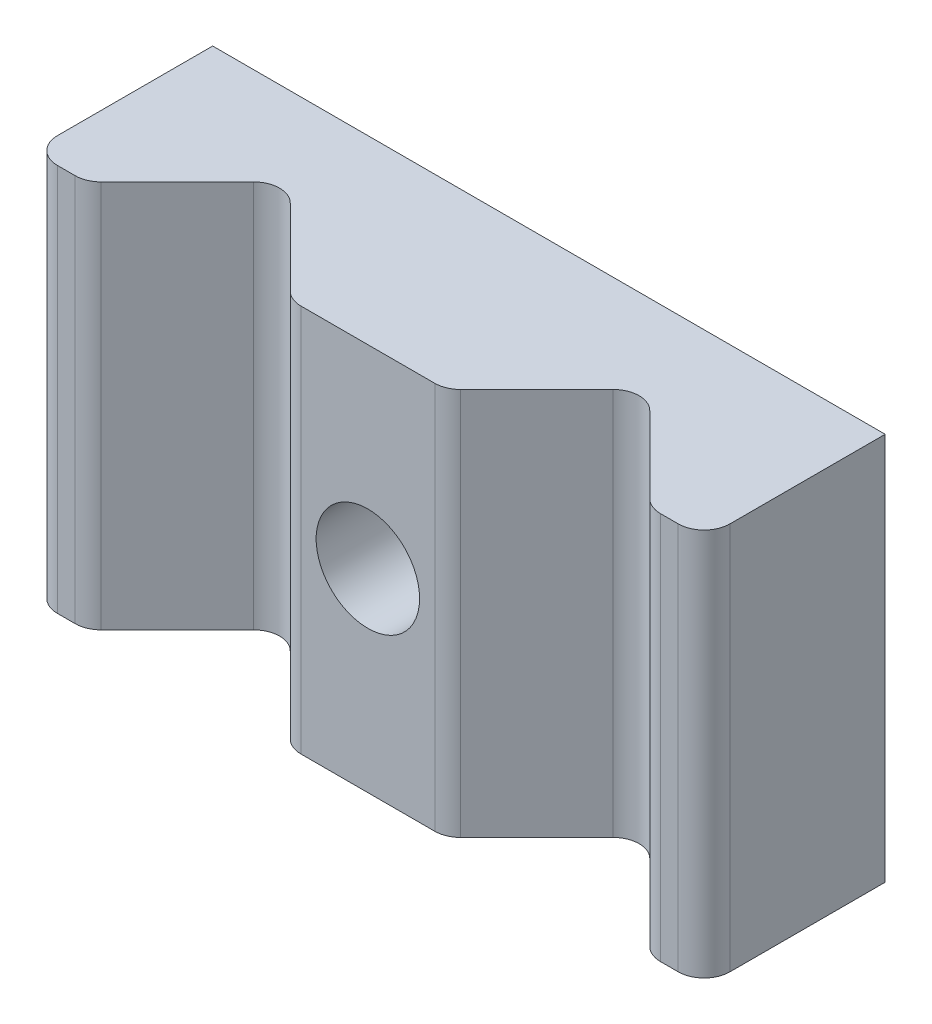
ISO-10303-21;
HEADER;
FILE_DESCRIPTION(('STEP AP214'),'2;1');
FILE_NAME('part.step','',(''),(''),'','','');
FILE_SCHEMA(('AUTOMOTIVE_DESIGN { 1 0 10303 214 1 1 1 1 }'));
ENDSEC;
DATA;
#1=APPLICATION_CONTEXT('core data for automotive mechanical design processes');
#2=APPLICATION_PROTOCOL_DEFINITION('international standard','automotive_design',2000,#1);
#3=PRODUCT_CONTEXT('',#1,'mechanical');
#4=PRODUCT('Part','Part','',(#3));
#5=PRODUCT_RELATED_PRODUCT_CATEGORY('part','',(#4));
#6=PRODUCT_DEFINITION_FORMATION('','',#4);
#7=PRODUCT_DEFINITION_CONTEXT('part definition',#1,'design');
#8=PRODUCT_DEFINITION('design','',#6,#7);
#9=PRODUCT_DEFINITION_SHAPE('','',#8);
#10=(LENGTH_UNIT() NAMED_UNIT(*) SI_UNIT(.MILLI.,.METRE.));
#11=(NAMED_UNIT(*) PLANE_ANGLE_UNIT() SI_UNIT($,.RADIAN.));
#12=(NAMED_UNIT(*) SI_UNIT($,.STERADIAN.) SOLID_ANGLE_UNIT());
#13=UNCERTAINTY_MEASURE_WITH_UNIT(LENGTH_MEASURE(1.E-05),#10,'distance_accuracy_value','');
#14=(GEOMETRIC_REPRESENTATION_CONTEXT(3) GLOBAL_UNCERTAINTY_ASSIGNED_CONTEXT((#13)) GLOBAL_UNIT_ASSIGNED_CONTEXT((#10,
#11,#12)) REPRESENTATION_CONTEXT('',''));
#15=CARTESIAN_POINT('',(0.,0.,0.));
#16=DIRECTION('',(0.,0.,1.));
#17=DIRECTION('',(1.,0.,0.));
#18=AXIS2_PLACEMENT_3D('',#15,#16,#17);
#19=CARTESIAN_POINT('',(0.,15.,7.));
#20=DIRECTION('',(0.,0.,-1.));
#21=DIRECTION('',(-1.,0.,0.));
#22=AXIS2_PLACEMENT_3D('',#19,#20,#21);
#23=PLANE('',#22);
#24=CARTESIAN_POINT('',(13.,7.5,7.));
#25=DIRECTION('',(0.,0.,1.));
#26=DIRECTION('',(1.,0.,0.));
#27=AXIS2_PLACEMENT_3D('',#24,#25,#26);
#28=CIRCLE('',#27,2.);
#29=CARTESIAN_POINT('',(15.,7.5,7.));
#30=VERTEX_POINT('',#29);
#31=EDGE_CURVE('E217',#30,#30,#28,.T.);
#32=ORIENTED_EDGE('',*,*,#31,.F.);
#33=EDGE_LOOP('',(#32));
#34=FACE_BOUND('',#33,.T.);
#35=DIRECTION('',(-1.,0.,0.));
#36=VECTOR('',#35,1.);
#37=CARTESIAN_POINT('',(0.,15.,7.));
#38=LINE('',#37,#36);
#39=CARTESIAN_POINT('',(15.5860389693211,15.,7.));
#40=VERTEX_POINT('',#39);
#41=CARTESIAN_POINT('',(10.4139610306789,15.,7.));
#42=VERTEX_POINT('',#41);
#43=EDGE_CURVE('E233',#40,#42,#38,.T.);
#44=ORIENTED_EDGE('',*,*,#43,.T.);
#45=DIRECTION('',(0.,1.,0.));
#46=VECTOR('',#45,1.);
#47=CARTESIAN_POINT('',(10.4139610306789,15.,7.));
#48=LINE('',#47,#46);
#49=CARTESIAN_POINT('',(10.4139610306789,0.,7.));
#50=VERTEX_POINT('',#49);
#51=EDGE_CURVE('E288',#42,#50,#48,.F.);
#52=ORIENTED_EDGE('',*,*,#51,.T.);
#53=DIRECTION('',(1.,0.,0.));
#54=VECTOR('',#53,1.);
#55=CARTESIAN_POINT('',(0.,0.,7.));
#56=LINE('',#55,#54);
#57=CARTESIAN_POINT('',(15.5860389693211,0.,7.));
#58=VERTEX_POINT('',#57);
#59=EDGE_CURVE('E226',#50,#58,#56,.T.);
#60=ORIENTED_EDGE('',*,*,#59,.T.);
#61=DIRECTION('',(0.,1.,0.));
#62=VECTOR('',#61,1.);
#63=CARTESIAN_POINT('',(15.5860389693211,15.,7.));
#64=LINE('',#63,#62);
#65=EDGE_CURVE('E285',#58,#40,#64,.T.);
#66=ORIENTED_EDGE('',*,*,#65,.T.);
#67=EDGE_LOOP('',(#44,#52,#60,#66));
#68=FACE_BOUND('',#67,.T.);
#69=ADVANCED_FACE('F33',(#34,#68),#23,.F.);
#70=CARTESIAN_POINT('',(1.68603896932107,15.,7.));
#71=VERTEX_POINT('',#70);
#72=CARTESIAN_POINT('',(1.,15.,7.));
#73=VERTEX_POINT('',#72);
#74=EDGE_CURVE('E234',#71,#73,#38,.T.);
#75=ORIENTED_EDGE('',*,*,#74,.T.);
#76=DIRECTION('',(0.,-1.,0.));
#77=VECTOR('',#76,1.);
#78=CARTESIAN_POINT('',(1.,15.,7.));
#79=LINE('',#78,#77);
#80=CARTESIAN_POINT('',(1.,0.,7.));
#81=VERTEX_POINT('',#80);
#82=EDGE_CURVE('E255',#73,#81,#79,.T.);
#83=ORIENTED_EDGE('',*,*,#82,.T.);
#84=CARTESIAN_POINT('',(1.68603896932108,0.,7.));
#85=VERTEX_POINT('',#84);
#86=EDGE_CURVE('E228',#81,#85,#56,.T.);
#87=ORIENTED_EDGE('',*,*,#86,.T.);
#88=DIRECTION('',(0.,1.,0.));
#89=VECTOR('',#88,1.);
#90=CARTESIAN_POINT('',(1.68603896932107,15.,7.));
#91=LINE('',#90,#89);
#92=EDGE_CURVE('E252',#85,#71,#91,.T.);
#93=ORIENTED_EDGE('',*,*,#92,.T.);
#94=EDGE_LOOP('',(#75,#83,#87,#93));
#95=FACE_BOUND('',#94,.T.);
#96=ADVANCED_FACE('F342',(#95),#23,.F.);
#97=CARTESIAN_POINT('',(25.,15.,7.));
#98=VERTEX_POINT('',#97);
#99=CARTESIAN_POINT('',(24.3139610306789,15.,7.));
#100=VERTEX_POINT('',#99);
#101=EDGE_CURVE('E229',#98,#100,#38,.T.);
#102=ORIENTED_EDGE('',*,*,#101,.T.);
#103=DIRECTION('',(0.,1.,0.));
#104=VECTOR('',#103,1.);
#105=CARTESIAN_POINT('',(24.3139610306789,15.,7.));
#106=LINE('',#105,#104);
#107=CARTESIAN_POINT('',(24.3139610306789,0.,7.));
#108=VERTEX_POINT('',#107);
#109=EDGE_CURVE('E41',#100,#108,#106,.F.);
#110=ORIENTED_EDGE('',*,*,#109,.T.);
#111=CARTESIAN_POINT('',(25.,0.,7.));
#112=VERTEX_POINT('',#111);
#113=EDGE_CURVE('E223',#108,#112,#56,.T.);
#114=ORIENTED_EDGE('',*,*,#113,.T.);
#115=DIRECTION('',(0.,1.,0.));
#116=VECTOR('',#115,1.);
#117=CARTESIAN_POINT('',(25.,15.,7.));
#118=LINE('',#117,#116);
#119=EDGE_CURVE('E294',#112,#98,#118,.T.);
#120=ORIENTED_EDGE('',*,*,#119,.T.);
#121=EDGE_LOOP('',(#102,#110,#114,#120));
#122=FACE_BOUND('',#121,.T.);
#123=ADVANCED_FACE('F298',(#122),#23,.F.);
#124=CARTESIAN_POINT('',(0.,15.,0.));
#125=DIRECTION('',(0.,0.,-1.));
#126=DIRECTION('',(-1.,0.,0.));
#127=AXIS2_PLACEMENT_3D('',#124,#125,#126);
#128=PLANE('',#127);
#129=DIRECTION('',(0.,-1.,0.));
#130=VECTOR('',#129,1.);
#131=CARTESIAN_POINT('',(0.,0.,0.));
#132=LINE('',#131,#130);
#133=CARTESIAN_POINT('',(0.,15.,0.));
#134=VERTEX_POINT('',#133);
#135=CARTESIAN_POINT('',(0.,0.,0.));
#136=VERTEX_POINT('',#135);
#137=EDGE_CURVE('E220',#134,#136,#132,.T.);
#138=ORIENTED_EDGE('',*,*,#137,.F.);
#139=DIRECTION('',(-1.,0.,0.));
#140=VECTOR('',#139,1.);
#141=CARTESIAN_POINT('',(0.,15.,0.));
#142=LINE('',#141,#140);
#143=CARTESIAN_POINT('',(26.,15.,0.));
#144=VERTEX_POINT('',#143);
#145=EDGE_CURVE('E227',#144,#134,#142,.T.);
#146=ORIENTED_EDGE('',*,*,#145,.F.);
#147=DIRECTION('',(0.,1.,0.));
#148=VECTOR('',#147,1.);
#149=CARTESIAN_POINT('',(26.,0.,0.));
#150=LINE('',#149,#148);
#151=CARTESIAN_POINT('',(26.,0.,0.));
#152=VERTEX_POINT('',#151);
#153=EDGE_CURVE('E240',#152,#144,#150,.T.);
#154=ORIENTED_EDGE('',*,*,#153,.F.);
#155=DIRECTION('',(1.,0.,0.));
#156=VECTOR('',#155,1.);
#157=CARTESIAN_POINT('',(0.,0.,0.));
#158=LINE('',#157,#156);
#159=EDGE_CURVE('E237',#136,#152,#158,.T.);
#160=ORIENTED_EDGE('',*,*,#159,.F.);
#161=EDGE_LOOP('',(#138,#146,#154,#160));
#162=FACE_BOUND('',#161,.T.);
#163=CARTESIAN_POINT('',(13.,7.5,0.));
#164=DIRECTION('',(0.,0.,1.));
#165=DIRECTION('',(1.,0.,0.));
#166=AXIS2_PLACEMENT_3D('',#163,#164,#165);
#167=CIRCLE('',#166,2.);
#168=CARTESIAN_POINT('',(15.,7.5,0.));
#169=VERTEX_POINT('',#168);
#170=EDGE_CURVE('E214',#169,#169,#167,.T.);
#171=ORIENTED_EDGE('',*,*,#170,.T.);
#172=EDGE_LOOP('',(#171));
#173=FACE_BOUND('',#172,.T.);
#174=ADVANCED_FACE('F354',(#162,#173),#128,.T.);
#175=CARTESIAN_POINT('',(0.,0.,7.));
#176=DIRECTION('',(1.,0.,0.));
#177=DIRECTION('',(0.,0.,-1.));
#178=AXIS2_PLACEMENT_3D('',#175,#176,#177);
#179=PLANE('',#178);
#180=DIRECTION('',(0.,0.,-1.));
#181=VECTOR('',#180,1.);
#182=CARTESIAN_POINT('',(0.,0.,7.));
#183=LINE('',#182,#181);
#184=CARTESIAN_POINT('',(0.,0.,6.));
#185=VERTEX_POINT('',#184);
#186=EDGE_CURVE('E250',#185,#136,#183,.T.);
#187=ORIENTED_EDGE('',*,*,#186,.F.);
#188=DIRECTION('',(0.,-1.,0.));
#189=VECTOR('',#188,1.);
#190=CARTESIAN_POINT('',(0.,0.,6.));
#191=LINE('',#190,#189);
#192=CARTESIAN_POINT('',(0.,15.,6.));
#193=VERTEX_POINT('',#192);
#194=EDGE_CURVE('E269',#185,#193,#191,.F.);
#195=ORIENTED_EDGE('',*,*,#194,.T.);
#196=DIRECTION('',(0.,0.,-1.));
#197=VECTOR('',#196,1.);
#198=CARTESIAN_POINT('',(0.,15.,7.));
#199=LINE('',#198,#197);
#200=EDGE_CURVE('E232',#193,#134,#199,.T.);
#201=ORIENTED_EDGE('',*,*,#200,.T.);
#202=ORIENTED_EDGE('',*,*,#137,.T.);
#203=EDGE_LOOP('',(#187,#195,#201,#202));
#204=FACE_BOUND('',#203,.T.);
#205=ADVANCED_FACE('F350',(#204),#179,.F.);
#206=CARTESIAN_POINT('',(0.,0.,7.));
#207=DIRECTION('',(0.,1.,0.));
#208=DIRECTION('',(-1.,0.,0.));
#209=AXIS2_PLACEMENT_3D('',#206,#207,#208);
#210=PLANE('',#209);
#211=ORIENTED_EDGE('',*,*,#86,.F.);
#212=CARTESIAN_POINT('',(1.,0.,6.));
#213=DIRECTION('',(0.,1.,0.));
#214=DIRECTION('',(-1.,0.,0.));
#215=AXIS2_PLACEMENT_3D('',#212,#213,#214);
#216=CIRCLE('',#215,1.);
#217=EDGE_CURVE('E267',#81,#185,#216,.F.);
#218=ORIENTED_EDGE('',*,*,#217,.T.);
#219=ORIENTED_EDGE('',*,*,#186,.T.);
#220=ORIENTED_EDGE('',*,*,#159,.T.);
#221=DIRECTION('',(0.,0.,-1.));
#222=VECTOR('',#221,1.);
#223=CARTESIAN_POINT('',(26.,0.,7.));
#224=LINE('',#223,#222);
#225=CARTESIAN_POINT('',(26.,0.,6.));
#226=VERTEX_POINT('',#225);
#227=EDGE_CURVE('E248',#226,#152,#224,.T.);
#228=ORIENTED_EDGE('',*,*,#227,.F.);
#229=CARTESIAN_POINT('',(25.,0.,6.));
#230=DIRECTION('',(0.,1.,0.));
#231=DIRECTION('',(-1.,0.,0.));
#232=AXIS2_PLACEMENT_3D('',#229,#230,#231);
#233=CIRCLE('',#232,1.);
#234=EDGE_CURVE('E258',#226,#112,#233,.F.);
#235=ORIENTED_EDGE('',*,*,#234,.T.);
#236=ORIENTED_EDGE('',*,*,#113,.F.);
#237=CARTESIAN_POINT('',(24.3139610306789,0.,6.));
#238=DIRECTION('',(0.,1.,0.));
#239=DIRECTION('',(-1.,0.,0.));
#240=AXIS2_PLACEMENT_3D('',#237,#238,#239);
#241=CIRCLE('',#240,1.);
#242=CARTESIAN_POINT('',(23.6068542494924,0.,6.70710678118655));
#243=VERTEX_POINT('',#242);
#244=EDGE_CURVE('E168',#108,#243,#241,.F.);
#245=ORIENTED_EDGE('',*,*,#244,.T.);
#246=DIRECTION('',(-0.707106781186548,0.,-0.707106781186547));
#247=VECTOR('',#246,1.);
#248=CARTESIAN_POINT('',(20.6571067811866,0.,3.75735931288072));
#249=LINE('',#248,#247);
#250=CARTESIAN_POINT('',(20.6571067811866,0.,3.75735931288071));
#251=VERTEX_POINT('',#250);
#252=EDGE_CURVE('E159',#243,#251,#249,.T.);
#253=ORIENTED_EDGE('',*,*,#252,.T.);
#254=CARTESIAN_POINT('',(19.95,0.,4.46446609406726));
#255=DIRECTION('',(0.,1.,0.));
#256=DIRECTION('',(1.,0.,0.));
#257=AXIS2_PLACEMENT_3D('',#254,#255,#256);
#258=CIRCLE('',#257,0.999999999999999);
#259=CARTESIAN_POINT('',(19.2428932188135,0.,3.75735931288072));
#260=VERTEX_POINT('',#259);
#261=EDGE_CURVE('E165',#251,#260,#258,.T.);
#262=ORIENTED_EDGE('',*,*,#261,.T.);
#263=DIRECTION('',(-0.707106781186548,0.,0.707106781186547));
#264=VECTOR('',#263,1.);
#265=CARTESIAN_POINT('',(16.0002525316942,0.,7.));
#266=LINE('',#265,#264);
#267=CARTESIAN_POINT('',(16.2931457505076,0.,6.70710678118655));
#268=VERTEX_POINT('',#267);
#269=EDGE_CURVE('E183',#260,#268,#266,.T.);
#270=ORIENTED_EDGE('',*,*,#269,.T.);
#271=CARTESIAN_POINT('',(15.5860389693211,0.,6.));
#272=DIRECTION('',(0.,1.,0.));
#273=DIRECTION('',(-1.,0.,0.));
#274=AXIS2_PLACEMENT_3D('',#271,#272,#273);
#275=CIRCLE('',#274,1.);
#276=EDGE_CURVE('E261',#268,#58,#275,.F.);
#277=ORIENTED_EDGE('',*,*,#276,.T.);
#278=ORIENTED_EDGE('',*,*,#59,.F.);
#279=CARTESIAN_POINT('',(10.4139610306789,0.,6.));
#280=DIRECTION('',(0.,1.,0.));
#281=DIRECTION('',(-1.,0.,0.));
#282=AXIS2_PLACEMENT_3D('',#279,#280,#281);
#283=CIRCLE('',#282,1.);
#284=CARTESIAN_POINT('',(9.70685424949238,0.,6.70710678118655));
#285=VERTEX_POINT('',#284);
#286=EDGE_CURVE('E263',#50,#285,#283,.F.);
#287=ORIENTED_EDGE('',*,*,#286,.T.);
#288=DIRECTION('',(-0.707106781186547,0.,-0.707106781186548));
#289=VECTOR('',#288,1.);
#290=CARTESIAN_POINT('',(6.75710678118655,0.,3.75735931288072));
#291=LINE('',#290,#289);
#292=CARTESIAN_POINT('',(6.75710678118655,0.,3.75735931288072));
#293=VERTEX_POINT('',#292);
#294=EDGE_CURVE('E197',#285,#293,#291,.T.);
#295=ORIENTED_EDGE('',*,*,#294,.T.);
#296=CARTESIAN_POINT('',(6.05,0.,4.46446609406726));
#297=DIRECTION('',(0.,1.,0.));
#298=DIRECTION('',(1.,0.,0.));
#299=AXIS2_PLACEMENT_3D('',#296,#297,#298);
#300=CIRCLE('',#299,0.999999999999999);
#301=CARTESIAN_POINT('',(5.34289321881346,0.,3.75735931288072));
#302=VERTEX_POINT('',#301);
#303=EDGE_CURVE('E199',#293,#302,#300,.T.);
#304=ORIENTED_EDGE('',*,*,#303,.T.);
#305=DIRECTION('',(-0.707106781186548,0.,0.707106781186547));
#306=VECTOR('',#305,1.);
#307=CARTESIAN_POINT('',(2.10025253169417,0.,7.));
#308=LINE('',#307,#306);
#309=CARTESIAN_POINT('',(2.39314575050763,0.,6.70710678118655));
#310=VERTEX_POINT('',#309);
#311=EDGE_CURVE('E203',#302,#310,#308,.T.);
#312=ORIENTED_EDGE('',*,*,#311,.T.);
#313=CARTESIAN_POINT('',(1.68603896932108,0.,6.));
#314=DIRECTION('',(0.,1.,0.));
#315=DIRECTION('',(-1.,0.,0.));
#316=AXIS2_PLACEMENT_3D('',#313,#314,#315);
#317=CIRCLE('',#316,1.);
#318=EDGE_CURVE('E265',#310,#85,#317,.F.);
#319=ORIENTED_EDGE('',*,*,#318,.T.);
#320=EDGE_LOOP('',(#211,#218,#219,#220,#228,#235,#236,#245,#253,#262,#270,#277,#278,#287,#295,
#304,#312,#319));
#321=FACE_BOUND('',#320,.T.);
#322=ADVANCED_FACE('F162',(#321),#210,.F.);
#323=CARTESIAN_POINT('',(26.,0.,7.));
#324=DIRECTION('',(-1.,0.,0.));
#325=DIRECTION('',(0.,-1.,0.));
#326=AXIS2_PLACEMENT_3D('',#323,#324,#325);
#327=PLANE('',#326);
#328=DIRECTION('',(0.,0.,-1.));
#329=VECTOR('',#328,1.);
#330=CARTESIAN_POINT('',(26.,15.,7.));
#331=LINE('',#330,#329);
#332=CARTESIAN_POINT('',(26.,15.,6.));
#333=VERTEX_POINT('',#332);
#334=EDGE_CURVE('E246',#333,#144,#331,.T.);
#335=ORIENTED_EDGE('',*,*,#334,.F.);
#336=DIRECTION('',(0.,1.,0.));
#337=VECTOR('',#336,1.);
#338=CARTESIAN_POINT('',(26.,0.,6.));
#339=LINE('',#338,#337);
#340=EDGE_CURVE('E11',#333,#226,#339,.F.);
#341=ORIENTED_EDGE('',*,*,#340,.T.);
#342=ORIENTED_EDGE('',*,*,#227,.T.);
#343=ORIENTED_EDGE('',*,*,#153,.T.);
#344=EDGE_LOOP('',(#335,#341,#342,#343));
#345=FACE_BOUND('',#344,.T.);
#346=ADVANCED_FACE('F361',(#345),#327,.F.);
#347=CARTESIAN_POINT('',(0.,15.,7.));
#348=DIRECTION('',(0.,-1.,0.));
#349=DIRECTION('',(1.,0.,0.));
#350=AXIS2_PLACEMENT_3D('',#347,#348,#349);
#351=PLANE('',#350);
#352=ORIENTED_EDGE('',*,*,#200,.F.);
#353=CARTESIAN_POINT('',(1.,15.,6.));
#354=DIRECTION('',(0.,-1.,0.));
#355=DIRECTION('',(1.,0.,0.));
#356=AXIS2_PLACEMENT_3D('',#353,#354,#355);
#357=CIRCLE('',#356,1.);
#358=EDGE_CURVE('E279',#193,#73,#357,.F.);
#359=ORIENTED_EDGE('',*,*,#358,.T.);
#360=ORIENTED_EDGE('',*,*,#74,.F.);
#361=CARTESIAN_POINT('',(1.68603896932107,15.,6.));
#362=DIRECTION('',(0.,-1.,0.));
#363=DIRECTION('',(1.,0.,0.));
#364=AXIS2_PLACEMENT_3D('',#361,#362,#363);
#365=CIRCLE('',#364,1.);
#366=CARTESIAN_POINT('',(2.39314575050762,15.,6.70710678118655));
#367=VERTEX_POINT('',#366);
#368=EDGE_CURVE('E56',#71,#367,#365,.F.);
#369=ORIENTED_EDGE('',*,*,#368,.T.);
#370=DIRECTION('',(-0.707106781186548,0.,0.707106781186547));
#371=VECTOR('',#370,1.);
#372=CARTESIAN_POINT('',(2.10025253169417,15.,7.));
#373=LINE('',#372,#371);
#374=CARTESIAN_POINT('',(5.34289321881345,15.,3.75735931288072));
#375=VERTEX_POINT('',#374);
#376=EDGE_CURVE('E200',#375,#367,#373,.T.);
#377=ORIENTED_EDGE('',*,*,#376,.F.);
#378=CARTESIAN_POINT('',(6.05,15.,4.46446609406726));
#379=DIRECTION('',(0.,1.,0.));
#380=DIRECTION('',(1.,0.,0.));
#381=AXIS2_PLACEMENT_3D('',#378,#379,#380);
#382=CIRCLE('',#381,0.999999999999999);
#383=CARTESIAN_POINT('',(6.75710678118655,15.,3.75735931288072));
#384=VERTEX_POINT('',#383);
#385=EDGE_CURVE('E208',#384,#375,#382,.T.);
#386=ORIENTED_EDGE('',*,*,#385,.F.);
#387=DIRECTION('',(-0.707106781186547,0.,-0.707106781186548));
#388=VECTOR('',#387,1.);
#389=CARTESIAN_POINT('',(6.75710678118655,15.,3.75735931288072));
#390=LINE('',#389,#388);
#391=CARTESIAN_POINT('',(9.70685424949238,15.,6.70710678118655));
#392=VERTEX_POINT('',#391);
#393=EDGE_CURVE('E195',#392,#384,#390,.T.);
#394=ORIENTED_EDGE('',*,*,#393,.F.);
#395=CARTESIAN_POINT('',(10.4139610306789,15.,6.));
#396=DIRECTION('',(0.,-1.,0.));
#397=DIRECTION('',(1.,0.,0.));
#398=AXIS2_PLACEMENT_3D('',#395,#396,#397);
#399=CIRCLE('',#398,1.);
#400=EDGE_CURVE('E48',#392,#42,#399,.F.);
#401=ORIENTED_EDGE('',*,*,#400,.T.);
#402=ORIENTED_EDGE('',*,*,#43,.F.);
#403=CARTESIAN_POINT('',(15.5860389693211,15.,6.));
#404=DIRECTION('',(0.,-1.,0.));
#405=DIRECTION('',(1.,0.,0.));
#406=AXIS2_PLACEMENT_3D('',#403,#404,#405);
#407=CIRCLE('',#406,1.);
#408=CARTESIAN_POINT('',(16.2931457505076,15.,6.70710678118655));
#409=VERTEX_POINT('',#408);
#410=EDGE_CURVE('E275',#40,#409,#407,.F.);
#411=ORIENTED_EDGE('',*,*,#410,.T.);
#412=DIRECTION('',(-0.707106781186548,0.,0.707106781186547));
#413=VECTOR('',#412,1.);
#414=CARTESIAN_POINT('',(16.0002525316942,15.,7.));
#415=LINE('',#414,#413);
#416=CARTESIAN_POINT('',(19.2428932188135,15.,3.75735931288072));
#417=VERTEX_POINT('',#416);
#418=EDGE_CURVE('E172',#417,#409,#415,.T.);
#419=ORIENTED_EDGE('',*,*,#418,.F.);
#420=CARTESIAN_POINT('',(19.95,15.,4.46446609406726));
#421=DIRECTION('',(0.,1.,0.));
#422=DIRECTION('',(1.,0.,0.));
#423=AXIS2_PLACEMENT_3D('',#420,#421,#422);
#424=CIRCLE('',#423,0.999999999999999);
#425=CARTESIAN_POINT('',(20.6571067811865,15.,3.75735931288071));
#426=VERTEX_POINT('',#425);
#427=EDGE_CURVE('E191',#426,#417,#424,.T.);
#428=ORIENTED_EDGE('',*,*,#427,.F.);
#429=DIRECTION('',(-0.707106781186548,0.,-0.707106781186547));
#430=VECTOR('',#429,1.);
#431=CARTESIAN_POINT('',(20.6571067811865,15.,3.75735931288072));
#432=LINE('',#431,#430);
#433=CARTESIAN_POINT('',(23.6068542494924,15.,6.70710678118655));
#434=VERTEX_POINT('',#433);
#435=EDGE_CURVE('E178',#434,#426,#432,.T.);
#436=ORIENTED_EDGE('',*,*,#435,.F.);
#437=CARTESIAN_POINT('',(24.3139610306789,15.,6.));
#438=DIRECTION('',(0.,-1.,0.));
#439=DIRECTION('',(1.,0.,0.));
#440=AXIS2_PLACEMENT_3D('',#437,#438,#439);
#441=CIRCLE('',#440,1.);
#442=EDGE_CURVE('E273',#434,#100,#441,.F.);
#443=ORIENTED_EDGE('',*,*,#442,.T.);
#444=ORIENTED_EDGE('',*,*,#101,.F.);
#445=CARTESIAN_POINT('',(25.,15.,6.));
#446=DIRECTION('',(0.,-1.,0.));
#447=DIRECTION('',(1.,0.,0.));
#448=AXIS2_PLACEMENT_3D('',#445,#446,#447);
#449=CIRCLE('',#448,1.);
#450=EDGE_CURVE('E271',#98,#333,#449,.F.);
#451=ORIENTED_EDGE('',*,*,#450,.T.);
#452=ORIENTED_EDGE('',*,*,#334,.T.);
#453=ORIENTED_EDGE('',*,*,#145,.T.);
#454=EDGE_LOOP('',(#352,#359,#360,#369,#377,#386,#394,#401,#402,#411,#419,#428,#436,#443,#444,
#451,#452,#453));
#455=FACE_BOUND('',#454,.T.);
#456=ADVANCED_FACE('F306',(#455),#351,.F.);
#457=CARTESIAN_POINT('',(13.,7.5,7.));
#458=DIRECTION('',(0.,0.,-1.));
#459=DIRECTION('',(-1.,0.,0.));
#460=AXIS2_PLACEMENT_3D('',#457,#458,#459);
#461=CYLINDRICAL_SURFACE('',#460,2.);
#462=ORIENTED_EDGE('',*,*,#31,.T.);
#463=EDGE_LOOP('',(#462));
#464=FACE_BOUND('',#463,.T.);
#465=ORIENTED_EDGE('',*,*,#170,.F.);
#466=EDGE_LOOP('',(#465));
#467=FACE_BOUND('',#466,.T.);
#468=ADVANCED_FACE('F368',(#464,#467),#461,.F.);
#469=CARTESIAN_POINT('',(2.10025253169417,0.,7.));
#470=DIRECTION('',(-0.707106781186547,0.,-0.707106781186548));
#471=DIRECTION('',(-0.707106781186548,0.,0.707106781186547));
#472=AXIS2_PLACEMENT_3D('',#469,#470,#471);
#473=PLANE('',#472);
#474=ORIENTED_EDGE('',*,*,#376,.T.);
#475=DIRECTION('',(0.,1.,0.));
#476=VECTOR('',#475,1.);
#477=CARTESIAN_POINT('',(2.39314575050763,0.,6.70710678118655));
#478=LINE('',#477,#476);
#479=EDGE_CURVE('E281',#367,#310,#478,.F.);
#480=ORIENTED_EDGE('',*,*,#479,.T.);
#481=ORIENTED_EDGE('',*,*,#311,.F.);
#482=DIRECTION('',(0.,1.,0.));
#483=VECTOR('',#482,1.);
#484=CARTESIAN_POINT('',(5.34289321881346,0.,3.75735931288072));
#485=LINE('',#484,#483);
#486=EDGE_CURVE('E212',#302,#375,#485,.T.);
#487=ORIENTED_EDGE('',*,*,#486,.T.);
#488=EDGE_LOOP('',(#474,#480,#481,#487));
#489=FACE_BOUND('',#488,.T.);
#490=ADVANCED_FACE('F465',(#489),#473,.F.);
#491=CARTESIAN_POINT('',(6.05,0.,4.46446609406726));
#492=DIRECTION('',(0.,1.,0.));
#493=DIRECTION('',(-1.,0.,0.));
#494=AXIS2_PLACEMENT_3D('',#491,#492,#493);
#495=CYLINDRICAL_SURFACE('',#494,0.999999999999999);
#496=ORIENTED_EDGE('',*,*,#385,.T.);
#497=ORIENTED_EDGE('',*,*,#486,.F.);
#498=ORIENTED_EDGE('',*,*,#303,.F.);
#499=DIRECTION('',(0.,1.,0.));
#500=VECTOR('',#499,1.);
#501=CARTESIAN_POINT('',(6.75710678118655,0.,3.75735931288072));
#502=LINE('',#501,#500);
#503=EDGE_CURVE('E206',#293,#384,#502,.T.);
#504=ORIENTED_EDGE('',*,*,#503,.T.);
#505=EDGE_LOOP('',(#496,#497,#498,#504));
#506=FACE_BOUND('',#505,.T.);
#507=ADVANCED_FACE('F335',(#506),#495,.F.);
#508=CARTESIAN_POINT('',(6.75710678118655,0.,3.75735931288072));
#509=DIRECTION('',(0.707106781186548,0.,-0.707106781186547));
#510=DIRECTION('',(-0.707106781186547,0.,-0.707106781186548));
#511=AXIS2_PLACEMENT_3D('',#508,#509,#510);
#512=PLANE('',#511);
#513=ORIENTED_EDGE('',*,*,#294,.F.);
#514=DIRECTION('',(0.,1.,0.));
#515=VECTOR('',#514,1.);
#516=CARTESIAN_POINT('',(9.70685424949238,0.,6.70710678118655));
#517=LINE('',#516,#515);
#518=EDGE_CURVE('E283',#285,#392,#517,.T.);
#519=ORIENTED_EDGE('',*,*,#518,.T.);
#520=ORIENTED_EDGE('',*,*,#393,.T.);
#521=ORIENTED_EDGE('',*,*,#503,.F.);
#522=EDGE_LOOP('',(#513,#519,#520,#521));
#523=FACE_BOUND('',#522,.T.);
#524=ADVANCED_FACE('F330',(#523),#512,.F.);
#525=CARTESIAN_POINT('',(16.0002525316942,0.,7.));
#526=DIRECTION('',(-0.707106781186547,0.,-0.707106781186548));
#527=DIRECTION('',(-0.707106781186548,0.,0.707106781186547));
#528=AXIS2_PLACEMENT_3D('',#525,#526,#527);
#529=PLANE('',#528);
#530=ORIENTED_EDGE('',*,*,#418,.T.);
#531=DIRECTION('',(0.,1.,0.));
#532=VECTOR('',#531,1.);
#533=CARTESIAN_POINT('',(16.2931457505076,0.,6.70710678118655));
#534=LINE('',#533,#532);
#535=EDGE_CURVE('E290',#409,#268,#534,.F.);
#536=ORIENTED_EDGE('',*,*,#535,.T.);
#537=ORIENTED_EDGE('',*,*,#269,.F.);
#538=DIRECTION('',(0.,1.,0.));
#539=VECTOR('',#538,1.);
#540=CARTESIAN_POINT('',(19.2428932188135,0.,3.75735931288072));
#541=LINE('',#540,#539);
#542=EDGE_CURVE('E182',#260,#417,#541,.T.);
#543=ORIENTED_EDGE('',*,*,#542,.T.);
#544=EDGE_LOOP('',(#530,#536,#537,#543));
#545=FACE_BOUND('',#544,.T.);
#546=ADVANCED_FACE('F311',(#545),#529,.F.);
#547=CARTESIAN_POINT('',(19.95,0.,4.46446609406726));
#548=DIRECTION('',(0.,1.,0.));
#549=DIRECTION('',(-1.,0.,0.));
#550=AXIS2_PLACEMENT_3D('',#547,#548,#549);
#551=CYLINDRICAL_SURFACE('',#550,0.999999999999999);
#552=ORIENTED_EDGE('',*,*,#427,.T.);
#553=ORIENTED_EDGE('',*,*,#542,.F.);
#554=ORIENTED_EDGE('',*,*,#261,.F.);
#555=DIRECTION('',(0.,1.,0.));
#556=VECTOR('',#555,1.);
#557=CARTESIAN_POINT('',(20.6571067811866,0.,3.75735931288071));
#558=LINE('',#557,#556);
#559=EDGE_CURVE('E175',#251,#426,#558,.T.);
#560=ORIENTED_EDGE('',*,*,#559,.T.);
#561=EDGE_LOOP('',(#552,#553,#554,#560));
#562=FACE_BOUND('',#561,.T.);
#563=ADVANCED_FACE('F185',(#562),#551,.F.);
#564=CARTESIAN_POINT('',(20.6571067811866,0.,3.75735931288072));
#565=DIRECTION('',(0.707106781186547,0.,-0.707106781186548));
#566=DIRECTION('',(-0.707106781186548,0.,-0.707106781186547));
#567=AXIS2_PLACEMENT_3D('',#564,#565,#566);
#568=PLANE('',#567);
#569=ORIENTED_EDGE('',*,*,#252,.F.);
#570=DIRECTION('',(0.,1.,0.));
#571=VECTOR('',#570,1.);
#572=CARTESIAN_POINT('',(23.6068542494924,0.,6.70710678118655));
#573=LINE('',#572,#571);
#574=EDGE_CURVE('E292',#243,#434,#573,.T.);
#575=ORIENTED_EDGE('',*,*,#574,.T.);
#576=ORIENTED_EDGE('',*,*,#435,.T.);
#577=ORIENTED_EDGE('',*,*,#559,.F.);
#578=EDGE_LOOP('',(#569,#575,#576,#577));
#579=FACE_BOUND('',#578,.T.);
#580=ADVANCED_FACE('F176',(#579),#568,.F.);
#581=CARTESIAN_POINT('',(1.,15.,6.));
#582=DIRECTION('',(0.,-1.,0.));
#583=DIRECTION('',(0.,0.,-1.));
#584=AXIS2_PLACEMENT_3D('',#581,#582,#583);
#585=CYLINDRICAL_SURFACE('',#584,1.);
#586=ORIENTED_EDGE('',*,*,#358,.F.);
#587=ORIENTED_EDGE('',*,*,#194,.F.);
#588=ORIENTED_EDGE('',*,*,#217,.F.);
#589=ORIENTED_EDGE('',*,*,#82,.F.);
#590=EDGE_LOOP('',(#586,#587,#588,#589));
#591=FACE_BOUND('',#590,.T.);
#592=ADVANCED_FACE('F346',(#591),#585,.T.);
#593=CARTESIAN_POINT('',(1.68603896932107,15.,6.));
#594=DIRECTION('',(0.,1.,0.));
#595=DIRECTION('',(-1.,0.,0.));
#596=AXIS2_PLACEMENT_3D('',#593,#594,#595);
#597=CYLINDRICAL_SURFACE('',#596,1.);
#598=ORIENTED_EDGE('',*,*,#318,.F.);
#599=ORIENTED_EDGE('',*,*,#479,.F.);
#600=ORIENTED_EDGE('',*,*,#368,.F.);
#601=ORIENTED_EDGE('',*,*,#92,.F.);
#602=EDGE_LOOP('',(#598,#599,#600,#601));
#603=FACE_BOUND('',#602,.T.);
#604=ADVANCED_FACE('F341',(#603),#597,.T.);
#605=CARTESIAN_POINT('',(10.4139610306789,0.,6.));
#606=DIRECTION('',(0.,1.,0.));
#607=DIRECTION('',(-1.,0.,0.));
#608=AXIS2_PLACEMENT_3D('',#605,#606,#607);
#609=CYLINDRICAL_SURFACE('',#608,1.);
#610=ORIENTED_EDGE('',*,*,#286,.F.);
#611=ORIENTED_EDGE('',*,*,#51,.F.);
#612=ORIENTED_EDGE('',*,*,#400,.F.);
#613=ORIENTED_EDGE('',*,*,#518,.F.);
#614=EDGE_LOOP('',(#610,#611,#612,#613));
#615=FACE_BOUND('',#614,.T.);
#616=ADVANCED_FACE('F326',(#615),#609,.T.);
#617=CARTESIAN_POINT('',(15.5860389693211,15.,6.));
#618=DIRECTION('',(0.,1.,0.));
#619=DIRECTION('',(-1.,0.,0.));
#620=AXIS2_PLACEMENT_3D('',#617,#618,#619);
#621=CYLINDRICAL_SURFACE('',#620,1.);
#622=ORIENTED_EDGE('',*,*,#276,.F.);
#623=ORIENTED_EDGE('',*,*,#535,.F.);
#624=ORIENTED_EDGE('',*,*,#410,.F.);
#625=ORIENTED_EDGE('',*,*,#65,.F.);
#626=EDGE_LOOP('',(#622,#623,#624,#625));
#627=FACE_BOUND('',#626,.T.);
#628=ADVANCED_FACE('F314',(#627),#621,.T.);
#629=CARTESIAN_POINT('',(24.3139610306789,0.,6.));
#630=DIRECTION('',(0.,1.,0.));
#631=DIRECTION('',(-1.,0.,0.));
#632=AXIS2_PLACEMENT_3D('',#629,#630,#631);
#633=CYLINDRICAL_SURFACE('',#632,1.);
#634=ORIENTED_EDGE('',*,*,#244,.F.);
#635=ORIENTED_EDGE('',*,*,#109,.F.);
#636=ORIENTED_EDGE('',*,*,#442,.F.);
#637=ORIENTED_EDGE('',*,*,#574,.F.);
#638=EDGE_LOOP('',(#634,#635,#636,#637));
#639=FACE_BOUND('',#638,.T.);
#640=ADVANCED_FACE('F304',(#639),#633,.T.);
#641=CARTESIAN_POINT('',(25.,15.,6.));
#642=DIRECTION('',(0.,1.,0.));
#643=DIRECTION('',(-1.,0.,0.));
#644=AXIS2_PLACEMENT_3D('',#641,#642,#643);
#645=CYLINDRICAL_SURFACE('',#644,1.);
#646=ORIENTED_EDGE('',*,*,#234,.F.);
#647=ORIENTED_EDGE('',*,*,#340,.F.);
#648=ORIENTED_EDGE('',*,*,#450,.F.);
#649=ORIENTED_EDGE('',*,*,#119,.F.);
#650=EDGE_LOOP('',(#646,#647,#648,#649));
#651=FACE_BOUND('',#650,.T.);
#652=ADVANCED_FACE('F35',(#651),#645,.T.);
#653=CLOSED_SHELL('',(#69,#96,#123,#174,#205,#322,#346,#456,#468,#490,#507,#524,#546,#563,#580,
#592,#604,#616,#628,#640,#652));
#654=MANIFOLD_SOLID_BREP('B2',#653);
#655=ADVANCED_BREP_SHAPE_REPRESENTATION('',(#18,#654),#14);
#656=SHAPE_DEFINITION_REPRESENTATION(#9,#655);
ENDSEC;
END-ISO-10303-21;
